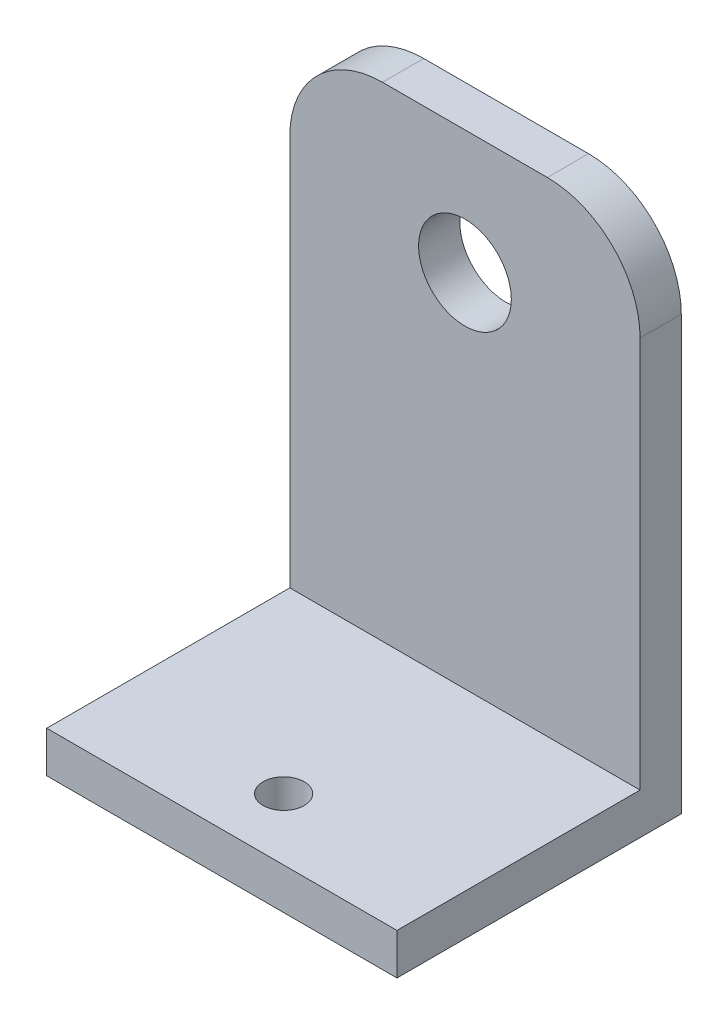
ISO-10303-21;
HEADER;
FILE_DESCRIPTION(('STEP AP214'),'2;1');
FILE_NAME('part.step','',(''),(''),'','','');
FILE_SCHEMA(('AUTOMOTIVE_DESIGN { 1 0 10303 214 1 1 1 1 }'));
ENDSEC;
DATA;
#1=APPLICATION_CONTEXT('core data for automotive mechanical design processes');
#2=APPLICATION_PROTOCOL_DEFINITION('international standard','automotive_design',2000,#1);
#3=PRODUCT_CONTEXT('',#1,'mechanical');
#4=PRODUCT('Part','Part','',(#3));
#5=PRODUCT_RELATED_PRODUCT_CATEGORY('part','',(#4));
#6=PRODUCT_DEFINITION_FORMATION('','',#4);
#7=PRODUCT_DEFINITION_CONTEXT('part definition',#1,'design');
#8=PRODUCT_DEFINITION('design','',#6,#7);
#9=PRODUCT_DEFINITION_SHAPE('','',#8);
#10=(LENGTH_UNIT() NAMED_UNIT(*) SI_UNIT(.MILLI.,.METRE.));
#11=(NAMED_UNIT(*) PLANE_ANGLE_UNIT() SI_UNIT($,.RADIAN.));
#12=(NAMED_UNIT(*) SI_UNIT($,.STERADIAN.) SOLID_ANGLE_UNIT());
#13=UNCERTAINTY_MEASURE_WITH_UNIT(LENGTH_MEASURE(1.E-05),#10,'distance_accuracy_value','');
#14=(GEOMETRIC_REPRESENTATION_CONTEXT(3) GLOBAL_UNCERTAINTY_ASSIGNED_CONTEXT((#13)) GLOBAL_UNIT_ASSIGNED_CONTEXT((#10,
#11,#12)) REPRESENTATION_CONTEXT('',''));
#15=CARTESIAN_POINT('',(0.,0.,0.));
#16=DIRECTION('',(0.,0.,1.));
#17=DIRECTION('',(1.,0.,0.));
#18=AXIS2_PLACEMENT_3D('',#15,#16,#17);
#19=CARTESIAN_POINT('',(0.,4.,0.));
#20=DIRECTION('',(0.,-1.,0.));
#21=DIRECTION('',(0.,0.,-1.));
#22=AXIS2_PLACEMENT_3D('',#19,#20,#21);
#23=PLANE('',#22);
#24=CARTESIAN_POINT('',(0.,4.,7.8));
#25=DIRECTION('',(0.,1.,0.));
#26=DIRECTION('',(0.,0.,1.));
#27=AXIS2_PLACEMENT_3D('',#24,#25,#26);
#28=CIRCLE('',#27,2.);
#29=CARTESIAN_POINT('',(0.,4.,9.8));
#30=VERTEX_POINT('',#29);
#31=EDGE_CURVE('E129',#30,#30,#28,.T.);
#32=ORIENTED_EDGE('',*,*,#31,.F.);
#33=EDGE_LOOP('',(#32));
#34=FACE_BOUND('',#33,.T.);
#35=DIRECTION('',(1.,0.,0.));
#36=VECTOR('',#35,1.);
#37=CARTESIAN_POINT('',(-17.,4.,-9.8));
#38=LINE('',#37,#36);
#39=CARTESIAN_POINT('',(-17.,4.,-9.8));
#40=VERTEX_POINT('',#39);
#41=CARTESIAN_POINT('',(17.,4.,-9.8));
#42=VERTEX_POINT('',#41);
#43=EDGE_CURVE('E108',#40,#42,#38,.T.);
#44=ORIENTED_EDGE('',*,*,#43,.F.);
#45=DIRECTION('',(0.,0.,1.));
#46=VECTOR('',#45,1.);
#47=CARTESIAN_POINT('',(-17.,4.,13.8));
#48=LINE('',#47,#46);
#49=CARTESIAN_POINT('',(-17.,4.,13.8));
#50=VERTEX_POINT('',#49);
#51=EDGE_CURVE('E113',#40,#50,#48,.T.);
#52=ORIENTED_EDGE('',*,*,#51,.T.);
#53=DIRECTION('',(1.,0.,0.));
#54=VECTOR('',#53,1.);
#55=CARTESIAN_POINT('',(-17.,4.,13.8));
#56=LINE('',#55,#54);
#57=CARTESIAN_POINT('',(17.,4.,13.8));
#58=VERTEX_POINT('',#57);
#59=EDGE_CURVE('E111',#50,#58,#56,.T.);
#60=ORIENTED_EDGE('',*,*,#59,.T.);
#61=DIRECTION('',(0.,0.,-1.));
#62=VECTOR('',#61,1.);
#63=CARTESIAN_POINT('',(17.,4.,13.8));
#64=LINE('',#63,#62);
#65=EDGE_CURVE('E100',#58,#42,#64,.T.);
#66=ORIENTED_EDGE('',*,*,#65,.T.);
#67=EDGE_LOOP('',(#44,#52,#60,#66));
#68=FACE_BOUND('',#67,.T.);
#69=ADVANCED_FACE('F33',(#34,#68),#23,.F.);
#70=CARTESIAN_POINT('',(0.,0.,0.));
#71=DIRECTION('',(0.,-1.,0.));
#72=DIRECTION('',(0.,0.,-1.));
#73=AXIS2_PLACEMENT_3D('',#70,#71,#72);
#74=PLANE('',#73);
#75=DIRECTION('',(0.,0.,-1.));
#76=VECTOR('',#75,1.);
#77=CARTESIAN_POINT('',(17.,0.,13.8));
#78=LINE('',#77,#76);
#79=CARTESIAN_POINT('',(17.,0.,13.8));
#80=VERTEX_POINT('',#79);
#81=CARTESIAN_POINT('',(17.,0.,-13.8));
#82=VERTEX_POINT('',#81);
#83=EDGE_CURVE('E132',#80,#82,#78,.T.);
#84=ORIENTED_EDGE('',*,*,#83,.F.);
#85=DIRECTION('',(1.,0.,0.));
#86=VECTOR('',#85,1.);
#87=CARTESIAN_POINT('',(-17.,0.,13.8));
#88=LINE('',#87,#86);
#89=CARTESIAN_POINT('',(-17.,0.,13.8));
#90=VERTEX_POINT('',#89);
#91=EDGE_CURVE('E114',#90,#80,#88,.T.);
#92=ORIENTED_EDGE('',*,*,#91,.F.);
#93=DIRECTION('',(0.,0.,1.));
#94=VECTOR('',#93,1.);
#95=CARTESIAN_POINT('',(-17.,0.,13.8));
#96=LINE('',#95,#94);
#97=CARTESIAN_POINT('',(-17.,0.,-13.8));
#98=VERTEX_POINT('',#97);
#99=EDGE_CURVE('E143',#98,#90,#96,.T.);
#100=ORIENTED_EDGE('',*,*,#99,.F.);
#101=DIRECTION('',(-1.,0.,0.));
#102=VECTOR('',#101,1.);
#103=CARTESIAN_POINT('',(-17.,0.,-13.8));
#104=LINE('',#103,#102);
#105=EDGE_CURVE('E140',#82,#98,#104,.T.);
#106=ORIENTED_EDGE('',*,*,#105,.F.);
#107=EDGE_LOOP('',(#84,#92,#100,#106));
#108=FACE_BOUND('',#107,.T.);
#109=CARTESIAN_POINT('',(0.,0.,7.8));
#110=DIRECTION('',(0.,1.,0.));
#111=DIRECTION('',(0.,0.,1.));
#112=AXIS2_PLACEMENT_3D('',#109,#110,#111);
#113=CIRCLE('',#112,2.);
#114=CARTESIAN_POINT('',(0.,0.,9.8));
#115=VERTEX_POINT('',#114);
#116=EDGE_CURVE('E128',#115,#115,#113,.T.);
#117=ORIENTED_EDGE('',*,*,#116,.T.);
#118=EDGE_LOOP('',(#117));
#119=FACE_BOUND('',#118,.T.);
#120=ADVANCED_FACE('F179',(#108,#119),#74,.T.);
#121=CARTESIAN_POINT('',(17.,4.,13.8));
#122=DIRECTION('',(-1.,0.,0.));
#123=DIRECTION('',(0.,0.,1.));
#124=AXIS2_PLACEMENT_3D('',#121,#122,#123);
#125=PLANE('',#124);
#126=DIRECTION('',(0.,-1.,0.));
#127=VECTOR('',#126,1.);
#128=CARTESIAN_POINT('',(17.,4.,-13.8));
#129=LINE('',#128,#127);
#130=CARTESIAN_POINT('',(17.,42.,-13.8));
#131=VERTEX_POINT('',#130);
#132=EDGE_CURVE('E152',#131,#82,#129,.T.);
#133=ORIENTED_EDGE('',*,*,#132,.F.);
#134=DIRECTION('',(0.,0.,-1.));
#135=VECTOR('',#134,1.);
#136=CARTESIAN_POINT('',(17.,42.,-9.8));
#137=LINE('',#136,#135);
#138=CARTESIAN_POINT('',(17.,42.,-9.8));
#139=VERTEX_POINT('',#138);
#140=EDGE_CURVE('E56',#131,#139,#137,.F.);
#141=ORIENTED_EDGE('',*,*,#140,.T.);
#142=DIRECTION('',(0.,-1.,0.));
#143=VECTOR('',#142,1.);
#144=CARTESIAN_POINT('',(17.,51.,-9.8));
#145=LINE('',#144,#143);
#146=EDGE_CURVE('E96',#139,#42,#145,.T.);
#147=ORIENTED_EDGE('',*,*,#146,.T.);
#148=ORIENTED_EDGE('',*,*,#65,.F.);
#149=DIRECTION('',(0.,-1.,0.));
#150=VECTOR('',#149,1.);
#151=CARTESIAN_POINT('',(17.,4.,13.8));
#152=LINE('',#151,#150);
#153=EDGE_CURVE('E137',#58,#80,#152,.T.);
#154=ORIENTED_EDGE('',*,*,#153,.T.);
#155=ORIENTED_EDGE('',*,*,#83,.T.);
#156=EDGE_LOOP('',(#133,#141,#147,#148,#154,#155));
#157=FACE_BOUND('',#156,.T.);
#158=ADVANCED_FACE('F98',(#157),#125,.F.);
#159=CARTESIAN_POINT('',(-17.,4.,-13.8));
#160=DIRECTION('',(0.,0.,1.));
#161=DIRECTION('',(1.,0.,0.));
#162=AXIS2_PLACEMENT_3D('',#159,#160,#161);
#163=PLANE('',#162);
#164=CARTESIAN_POINT('',(0.,39.,-13.8));
#165=DIRECTION('',(0.,0.,1.));
#166=DIRECTION('',(1.,0.,0.));
#167=AXIS2_PLACEMENT_3D('',#164,#165,#166);
#168=CIRCLE('',#167,4.49999999999995);
#169=CARTESIAN_POINT('',(4.49999999999995,39.,-13.8));
#170=VERTEX_POINT('',#169);
#171=EDGE_CURVE('E118',#170,#170,#168,.T.);
#172=ORIENTED_EDGE('',*,*,#171,.T.);
#173=EDGE_LOOP('',(#172));
#174=FACE_BOUND('',#173,.T.);
#175=DIRECTION('',(-1.,0.,0.));
#176=VECTOR('',#175,1.);
#177=CARTESIAN_POINT('',(-17.,51.,-13.8));
#178=LINE('',#177,#176);
#179=CARTESIAN_POINT('',(8.,51.,-13.8));
#180=VERTEX_POINT('',#179);
#181=CARTESIAN_POINT('',(-8.,51.,-13.8));
#182=VERTEX_POINT('',#181);
#183=EDGE_CURVE('E104',#180,#182,#178,.T.);
#184=ORIENTED_EDGE('',*,*,#183,.F.);
#185=CARTESIAN_POINT('',(8.00000000000001,42.,-13.8));
#186=DIRECTION('',(0.,0.,1.));
#187=DIRECTION('',(1.,0.,0.));
#188=AXIS2_PLACEMENT_3D('',#185,#186,#187);
#189=CIRCLE('',#188,9.);
#190=EDGE_CURVE('E162',#180,#131,#189,.F.);
#191=ORIENTED_EDGE('',*,*,#190,.T.);
#192=ORIENTED_EDGE('',*,*,#132,.T.);
#193=ORIENTED_EDGE('',*,*,#105,.T.);
#194=DIRECTION('',(0.,-1.,0.));
#195=VECTOR('',#194,1.);
#196=CARTESIAN_POINT('',(-17.,4.,-13.8));
#197=LINE('',#196,#195);
#198=CARTESIAN_POINT('',(-17.,42.,-13.8));
#199=VERTEX_POINT('',#198);
#200=EDGE_CURVE('E150',#199,#98,#197,.T.);
#201=ORIENTED_EDGE('',*,*,#200,.F.);
#202=CARTESIAN_POINT('',(-8.,42.,-13.8));
#203=DIRECTION('',(0.,0.,1.));
#204=DIRECTION('',(1.,0.,0.));
#205=AXIS2_PLACEMENT_3D('',#202,#203,#204);
#206=CIRCLE('',#205,9.);
#207=EDGE_CURVE('E160',#199,#182,#206,.F.);
#208=ORIENTED_EDGE('',*,*,#207,.T.);
#209=EDGE_LOOP('',(#184,#191,#192,#193,#201,#208));
#210=FACE_BOUND('',#209,.T.);
#211=ADVANCED_FACE('F174',(#174,#210),#163,.F.);
#212=CARTESIAN_POINT('',(-17.,4.,13.8));
#213=DIRECTION('',(1.,0.,0.));
#214=DIRECTION('',(0.,0.,-1.));
#215=AXIS2_PLACEMENT_3D('',#212,#213,#214);
#216=PLANE('',#215);
#217=DIRECTION('',(0.,-1.,0.));
#218=VECTOR('',#217,1.);
#219=CARTESIAN_POINT('',(-17.,51.,-9.8));
#220=LINE('',#219,#218);
#221=CARTESIAN_POINT('',(-17.,42.,-9.8));
#222=VERTEX_POINT('',#221);
#223=EDGE_CURVE('E103',#222,#40,#220,.T.);
#224=ORIENTED_EDGE('',*,*,#223,.F.);
#225=DIRECTION('',(0.,0.,1.));
#226=VECTOR('',#225,1.);
#227=CARTESIAN_POINT('',(-17.,42.,-13.8));
#228=LINE('',#227,#226);
#229=EDGE_CURVE('E11',#222,#199,#228,.F.);
#230=ORIENTED_EDGE('',*,*,#229,.T.);
#231=ORIENTED_EDGE('',*,*,#200,.T.);
#232=ORIENTED_EDGE('',*,*,#99,.T.);
#233=DIRECTION('',(0.,-1.,0.));
#234=VECTOR('',#233,1.);
#235=CARTESIAN_POINT('',(-17.,4.,13.8));
#236=LINE('',#235,#234);
#237=EDGE_CURVE('E147',#50,#90,#236,.T.);
#238=ORIENTED_EDGE('',*,*,#237,.F.);
#239=ORIENTED_EDGE('',*,*,#51,.F.);
#240=EDGE_LOOP('',(#224,#230,#231,#232,#238,#239));
#241=FACE_BOUND('',#240,.T.);
#242=ADVANCED_FACE('F187',(#241),#216,.F.);
#243=CARTESIAN_POINT('',(-17.,4.,13.8));
#244=DIRECTION('',(0.,0.,-1.));
#245=DIRECTION('',(-1.,0.,0.));
#246=AXIS2_PLACEMENT_3D('',#243,#244,#245);
#247=PLANE('',#246);
#248=ORIENTED_EDGE('',*,*,#91,.T.);
#249=ORIENTED_EDGE('',*,*,#153,.F.);
#250=ORIENTED_EDGE('',*,*,#59,.F.);
#251=ORIENTED_EDGE('',*,*,#237,.T.);
#252=EDGE_LOOP('',(#248,#249,#250,#251));
#253=FACE_BOUND('',#252,.T.);
#254=ADVANCED_FACE('F190',(#253),#247,.F.);
#255=CARTESIAN_POINT('',(0.,4.,7.8));
#256=DIRECTION('',(0.,-1.,0.));
#257=DIRECTION('',(0.,0.,-1.));
#258=AXIS2_PLACEMENT_3D('',#255,#256,#257);
#259=CYLINDRICAL_SURFACE('',#258,2.);
#260=ORIENTED_EDGE('',*,*,#31,.T.);
#261=EDGE_LOOP('',(#260));
#262=FACE_BOUND('',#261,.T.);
#263=ORIENTED_EDGE('',*,*,#116,.F.);
#264=EDGE_LOOP('',(#263));
#265=FACE_BOUND('',#264,.T.);
#266=ADVANCED_FACE('F192',(#262,#265),#259,.F.);
#267=CARTESIAN_POINT('',(-17.,51.,-9.8));
#268=DIRECTION('',(0.,0.,-1.));
#269=DIRECTION('',(-1.,0.,0.));
#270=AXIS2_PLACEMENT_3D('',#267,#268,#269);
#271=PLANE('',#270);
#272=CARTESIAN_POINT('',(0.,39.,-9.8));
#273=DIRECTION('',(0.,0.,1.));
#274=DIRECTION('',(1.,0.,0.));
#275=AXIS2_PLACEMENT_3D('',#272,#273,#274);
#276=CIRCLE('',#275,4.49999999999995);
#277=CARTESIAN_POINT('',(4.49999999999995,39.,-9.8));
#278=VERTEX_POINT('',#277);
#279=EDGE_CURVE('E123',#278,#278,#276,.T.);
#280=ORIENTED_EDGE('',*,*,#279,.F.);
#281=EDGE_LOOP('',(#280));
#282=FACE_BOUND('',#281,.T.);
#283=ORIENTED_EDGE('',*,*,#146,.F.);
#284=CARTESIAN_POINT('',(8.00000000000001,42.,-9.8));
#285=DIRECTION('',(0.,0.,-1.));
#286=DIRECTION('',(-1.,0.,0.));
#287=AXIS2_PLACEMENT_3D('',#284,#285,#286);
#288=CIRCLE('',#287,9.);
#289=CARTESIAN_POINT('',(8.,51.,-9.8));
#290=VERTEX_POINT('',#289);
#291=EDGE_CURVE('E41',#139,#290,#288,.F.);
#292=ORIENTED_EDGE('',*,*,#291,.T.);
#293=DIRECTION('',(1.,0.,0.));
#294=VECTOR('',#293,1.);
#295=CARTESIAN_POINT('',(-17.,51.,-9.8));
#296=LINE('',#295,#294);
#297=CARTESIAN_POINT('',(-8.,51.,-9.8));
#298=VERTEX_POINT('',#297);
#299=EDGE_CURVE('E117',#298,#290,#296,.T.);
#300=ORIENTED_EDGE('',*,*,#299,.F.);
#301=CARTESIAN_POINT('',(-8.,42.,-9.8));
#302=DIRECTION('',(0.,0.,-1.));
#303=DIRECTION('',(-1.,0.,0.));
#304=AXIS2_PLACEMENT_3D('',#301,#302,#303);
#305=CIRCLE('',#304,9.);
#306=EDGE_CURVE('E48',#298,#222,#305,.F.);
#307=ORIENTED_EDGE('',*,*,#306,.T.);
#308=ORIENTED_EDGE('',*,*,#223,.T.);
#309=ORIENTED_EDGE('',*,*,#43,.T.);
#310=EDGE_LOOP('',(#283,#292,#300,#307,#308,#309));
#311=FACE_BOUND('',#310,.T.);
#312=ADVANCED_FACE('F116',(#282,#311),#271,.F.);
#313=CARTESIAN_POINT('',(0.,51.,0.));
#314=DIRECTION('',(0.,1.,0.));
#315=DIRECTION('',(0.,0.,1.));
#316=AXIS2_PLACEMENT_3D('',#313,#314,#315);
#317=PLANE('',#316);
#318=ORIENTED_EDGE('',*,*,#299,.T.);
#319=DIRECTION('',(0.,0.,-1.));
#320=VECTOR('',#319,1.);
#321=CARTESIAN_POINT('',(8.00000000000001,51.,-13.8));
#322=LINE('',#321,#320);
#323=EDGE_CURVE('E157',#290,#180,#322,.T.);
#324=ORIENTED_EDGE('',*,*,#323,.T.);
#325=ORIENTED_EDGE('',*,*,#183,.T.);
#326=DIRECTION('',(0.,0.,1.));
#327=VECTOR('',#326,1.);
#328=CARTESIAN_POINT('',(-8.,51.,-9.8));
#329=LINE('',#328,#327);
#330=EDGE_CURVE('E154',#182,#298,#329,.T.);
#331=ORIENTED_EDGE('',*,*,#330,.T.);
#332=EDGE_LOOP('',(#318,#324,#325,#331));
#333=FACE_BOUND('',#332,.T.);
#334=ADVANCED_FACE('F168',(#333),#317,.T.);
#335=CARTESIAN_POINT('',(8.00000000000001,42.,0.));
#336=DIRECTION('',(0.,0.,1.));
#337=DIRECTION('',(1.,0.,0.));
#338=AXIS2_PLACEMENT_3D('',#335,#336,#337);
#339=CYLINDRICAL_SURFACE('',#338,9.);
#340=ORIENTED_EDGE('',*,*,#291,.F.);
#341=ORIENTED_EDGE('',*,*,#140,.F.);
#342=ORIENTED_EDGE('',*,*,#190,.F.);
#343=ORIENTED_EDGE('',*,*,#323,.F.);
#344=EDGE_LOOP('',(#340,#341,#342,#343));
#345=FACE_BOUND('',#344,.T.);
#346=ADVANCED_FACE('F172',(#345),#339,.T.);
#347=CARTESIAN_POINT('',(-8.,42.,0.));
#348=DIRECTION('',(0.,0.,-1.));
#349=DIRECTION('',(-1.,0.,0.));
#350=AXIS2_PLACEMENT_3D('',#347,#348,#349);
#351=CYLINDRICAL_SURFACE('',#350,9.);
#352=ORIENTED_EDGE('',*,*,#207,.F.);
#353=ORIENTED_EDGE('',*,*,#229,.F.);
#354=ORIENTED_EDGE('',*,*,#306,.F.);
#355=ORIENTED_EDGE('',*,*,#330,.F.);
#356=EDGE_LOOP('',(#352,#353,#354,#355));
#357=FACE_BOUND('',#356,.T.);
#358=ADVANCED_FACE('F35',(#357),#351,.T.);
#359=CARTESIAN_POINT('',(0.,39.,-13.8));
#360=DIRECTION('',(0.,0.,1.));
#361=DIRECTION('',(1.,0.,0.));
#362=AXIS2_PLACEMENT_3D('',#359,#360,#361);
#363=CYLINDRICAL_SURFACE('',#362,4.49999999999995);
#364=ORIENTED_EDGE('',*,*,#171,.F.);
#365=EDGE_LOOP('',(#364));
#366=FACE_BOUND('',#365,.T.);
#367=ORIENTED_EDGE('',*,*,#279,.T.);
#368=EDGE_LOOP('',(#367));
#369=FACE_BOUND('',#368,.T.);
#370=ADVANCED_FACE('F215',(#366,#369),#363,.F.);
#371=CLOSED_SHELL('',(#69,#120,#158,#211,#242,#254,#266,#312,#334,#346,#358,#370));
#372=MANIFOLD_SOLID_BREP('B2',#371);
#373=ADVANCED_BREP_SHAPE_REPRESENTATION('',(#18,#372),#14);
#374=SHAPE_DEFINITION_REPRESENTATION(#9,#373);
ENDSEC;
END-ISO-10303-21;
